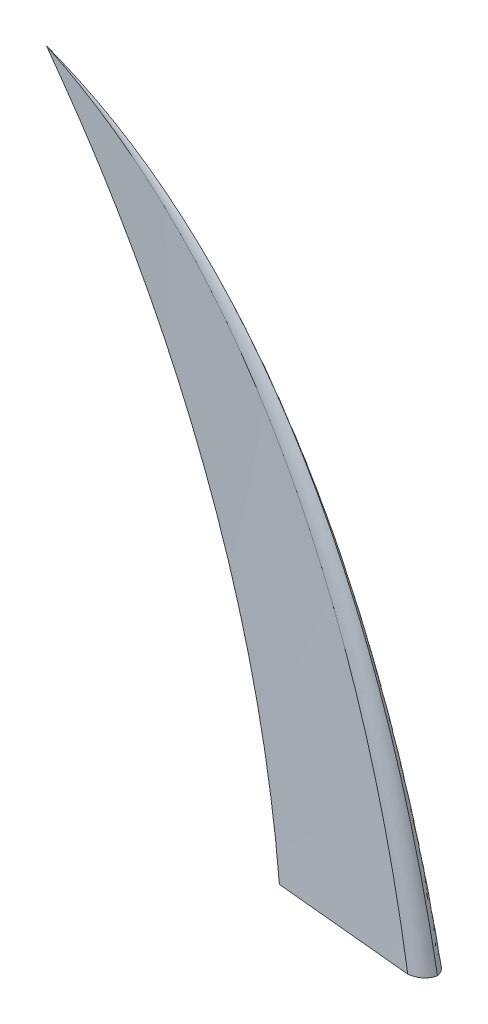
ISO-10303-21;
HEADER;
FILE_DESCRIPTION(('STEP AP214'),'2;1');
FILE_NAME('part.step','',(''),(''),'','','');
FILE_SCHEMA(('AUTOMOTIVE_DESIGN { 1 0 10303 214 1 1 1 1 }'));
ENDSEC;
DATA;
#1=APPLICATION_CONTEXT('core data for automotive mechanical design processes');
#2=APPLICATION_PROTOCOL_DEFINITION('international standard','automotive_design',2000,#1);
#3=PRODUCT_CONTEXT('',#1,'mechanical');
#4=PRODUCT('Part','Part','',(#3));
#5=PRODUCT_RELATED_PRODUCT_CATEGORY('part','',(#4));
#6=PRODUCT_DEFINITION_FORMATION('','',#4);
#7=PRODUCT_DEFINITION_CONTEXT('part definition',#1,'design');
#8=PRODUCT_DEFINITION('design','',#6,#7);
#9=PRODUCT_DEFINITION_SHAPE('','',#8);
#10=(LENGTH_UNIT() NAMED_UNIT(*) SI_UNIT(.MILLI.,.METRE.));
#11=(NAMED_UNIT(*) PLANE_ANGLE_UNIT() SI_UNIT($,.RADIAN.));
#12=(NAMED_UNIT(*) SI_UNIT($,.STERADIAN.) SOLID_ANGLE_UNIT());
#13=UNCERTAINTY_MEASURE_WITH_UNIT(LENGTH_MEASURE(1.E-05),#10,'distance_accuracy_value','');
#14=(GEOMETRIC_REPRESENTATION_CONTEXT(3) GLOBAL_UNCERTAINTY_ASSIGNED_CONTEXT((#13)) GLOBAL_UNIT_ASSIGNED_CONTEXT((#10,
#11,#12)) REPRESENTATION_CONTEXT('',''));
#15=CARTESIAN_POINT('',(0.,0.,0.));
#16=DIRECTION('',(0.,0.,1.));
#17=DIRECTION('',(1.,0.,0.));
#18=AXIS2_PLACEMENT_3D('',#15,#16,#17);
#19=CARTESIAN_POINT('',(-0.441611795280018,0.,-0.759416342925097));
#20=DIRECTION('',(0.,-1.,0.));
#21=DIRECTION('',(0.,0.,-1.));
#22=AXIS2_PLACEMENT_3D('',#19,#20,#21);
#23=PLANE('',#22);
#24=CARTESIAN_POINT('',(0.,0.,0.));
#25=CARTESIAN_POINT('',(-0.0350272810139364,0.,-0.159525126260187));
#26=CARTESIAN_POINT('',(-0.143656527907876,0.,-0.445619643007891));
#27=CARTESIAN_POINT('',(-0.422324452846984,0.,-0.775894210811432));
#28=CARTESIAN_POINT('',(-0.816716432384294,0.,-1.00730157129696));
#29=CARTESIAN_POINT('',(-1.15679378847463,0.,-1.09566167340864));
#30=CARTESIAN_POINT('',(-1.34611980895284,0.,-1.12336385657814));
#31=B_SPLINE_CURVE_WITH_KNOTS('',3,(#24,#25,#26,#27,#28,#29,#30),.UNSPECIFIED.,.F.,.F.,(4,1,1,1,
4),(0.,0.0325559858699069,0.0651119717398139,0.0976679576097208,0.130223943479628),.UNSPECIFIED.);
#32=CARTESIAN_POINT('',(0.,0.,0.));
#33=VERTEX_POINT('',#32);
#34=CARTESIAN_POINT('',(-1.34611980895284,0.,-1.12336385657814));
#35=VERTEX_POINT('',#34);
#36=EDGE_CURVE('E13',#33,#35,#31,.T.);
#37=ORIENTED_EDGE('',*,*,#36,.F.);
#38=CARTESIAN_POINT('',(-1.34611980895284,0.,1.12336385657814));
#39=CARTESIAN_POINT('',(-1.15679378847463,0.,1.09566167340864));
#40=CARTESIAN_POINT('',(-0.816716432384295,0.,1.00730157129696));
#41=CARTESIAN_POINT('',(-0.422324452846984,0.,0.775894210811432));
#42=CARTESIAN_POINT('',(-0.143656527907876,0.,0.44561964300789));
#43=CARTESIAN_POINT('',(-0.0350272810139364,0.,0.159525126260187));
#44=CARTESIAN_POINT('',(0.,0.,0.));
#45=B_SPLINE_CURVE_WITH_KNOTS('',3,(#38,#39,#40,#41,#42,#43,#44),.UNSPECIFIED.,.F.,.F.,(4,1,1,1,
4),(0.869776084203496,0.902332063152622,0.934888042101748,0.967444021050874,1.),.UNSPECIFIED.);
#46=CARTESIAN_POINT('',(-1.34611980895284,0.,1.12336385657814));
#47=VERTEX_POINT('',#46);
#48=EDGE_CURVE('E98',#47,#33,#45,.T.);
#49=ORIENTED_EDGE('',*,*,#48,.F.);
#50=DIRECTION('',(0.995482974612352,0.,0.0949402299183242));
#51=VECTOR('',#50,1.);
#52=CARTESIAN_POINT('',(-7.23555990447642,0.,0.56168192828907));
#53=LINE('',#52,#51);
#54=CARTESIAN_POINT('',(-13.125,0.,0.));
#55=VERTEX_POINT('',#54);
#56=EDGE_CURVE('E87',#55,#47,#53,.T.);
#57=ORIENTED_EDGE('',*,*,#56,.F.);
#58=DIRECTION('',(-0.995482974612352,0.,0.0949402299183241));
#59=VECTOR('',#58,1.);
#60=CARTESIAN_POINT('',(-7.23555990447642,0.,-0.56168192828907));
#61=LINE('',#60,#59);
#62=EDGE_CURVE('E82',#35,#55,#61,.T.);
#63=ORIENTED_EDGE('',*,*,#62,.F.);
#64=EDGE_LOOP('',(#37,#49,#57,#63));
#65=FACE_BOUND('',#64,.T.);
#66=ADVANCED_FACE('F66',(#65),#23,.T.);
#67=CARTESIAN_POINT('',(0.,0.,0.));
#68=CARTESIAN_POINT('',(-3.64642343566585,19.5292195969327,0.));
#69=CARTESIAN_POINT('',(-12.3464493503701,43.1462647461359,0.));
#70=CARTESIAN_POINT('',(-32.4324240557592,50.6,0.));
#71=CARTESIAN_POINT('',(-0.0350272810139364,0.,-0.159525126260187));
#72=CARTESIAN_POINT('',(-3.69497272898941,19.514977188393,-0.106453625897233));
#73=CARTESIAN_POINT('',(-12.409402297454,43.0680553468621,-0.0533821255342788));
#74=CARTESIAN_POINT('',(-32.4327798082133,50.6,-0.000310625171324509));
#75=CARTESIAN_POINT('',(-0.143656527907876,0.,-0.445619643007891));
#76=CARTESIAN_POINT('',(-3.81778777221389,19.4864923713136,-0.297390387176585));
#77=CARTESIAN_POINT('',(-12.5481664199104,42.9116365483146,-0.149161131345279));
#78=CARTESIAN_POINT('',(-32.4334913131214,50.6,-0.000931875513973526));
#79=CARTESIAN_POINT('',(-0.422324452846984,0.,-0.775894210811432));
#80=CARTESIAN_POINT('',(-4.07915970678275,19.4437651456945,-0.517884057550271));
#81=CARTESIAN_POINT('',(-12.794887288461,42.6770083504934,-0.259873904289109));
#82=CARTESIAN_POINT('',(-32.4345585704836,50.6,-0.00186375102794705));
#83=CARTESIAN_POINT('',(-0.816716432384294,0.,-1.00730157129696));
#84=CARTESIAN_POINT('',(-4.41768101108374,19.4010379200754,-0.672466256378614));
#85=CARTESIAN_POINT('',(-13.0801828418777,42.4423801526722,-0.337630941460267));
#86=CARTESIAN_POINT('',(-32.4356258278458,50.6,-0.00279562654192058));
#87=CARTESIAN_POINT('',(-1.15679378847463,0.,-1.09566167340864));
#88=CARTESIAN_POINT('',(-4.69479479377249,19.372553102996,-0.731580074567282));
#89=CARTESIAN_POINT('',(-13.2960963340662,42.2859613541247,-0.367498475725926));
#90=CARTESIAN_POINT('',(-32.4363373327539,50.6,-0.0034168768845696));
#91=CARTESIAN_POINT('',(-1.34611980895284,0.,-1.12336385657814));
#92=CARTESIAN_POINT('',(-4.84620991340555,19.3583106944563,-0.750151738404059));
#93=CARTESIAN_POINT('',(-13.4104821943048,42.2077519548509,-0.376939620229976));
#94=CARTESIAN_POINT('',(-32.436693085208,50.6,-0.00372750205589411));
#95=B_SPLINE_SURFACE_WITH_KNOTS('',3,3,((#67,#68,#69,#70),(#71,#72,#73,#74),(#75,#76,#77,#78),
(#79,#80,#81,#82),(#83,#84,#85,#86),(#87,#88,#89,#90),(#91,#92,#93,#94)),.UNSPECIFIED.,.F.,.F.,
.F.,(4,1,1,1,4),(4,4),(0.,0.0325559858699069,0.0651119717398139,0.0976679576097208,
0.130223943479628),(0.,1.),.UNSPECIFIED.);
#96=CARTESIAN_POINT('',(-1.34611980895284,0.,-1.12336385657814));
#97=CARTESIAN_POINT('',(-4.84620991340555,19.3583106944563,-0.750151738404059));
#98=CARTESIAN_POINT('',(-13.4104821943048,42.2077519548509,-0.376939620229976));
#99=CARTESIAN_POINT('',(-32.436693085208,50.6,-0.00372750205589411));
#100=B_SPLINE_CURVE_WITH_KNOTS('',3,(#96,#97,#98,#99),.UNSPECIFIED.,.F.,.F.,(4,4),(0.,1.),.UNSPECIFIED.);
#101=CARTESIAN_POINT('',(-32.4506815676374,50.6,0.));
#102=VERTEX_POINT('',#101);
#103=EDGE_CURVE('E75',#35,#102,#100,.T.);
#104=CARTESIAN_POINT('',(0.,0.,0.));
#105=CARTESIAN_POINT('',(-3.64642343566585,19.5292195969327,0.));
#106=CARTESIAN_POINT('',(-12.3464493503701,43.1462647461359,0.));
#107=CARTESIAN_POINT('',(-32.4324240557592,50.6,0.));
#108=B_SPLINE_CURVE_WITH_KNOTS('',3,(#104,#105,#106,#107),.UNSPECIFIED.,.F.,.F.,(4,4),(0.,1.),.UNSPECIFIED.);
#109=EDGE_CURVE('E101',#33,#102,#108,.T.);
#110=ORIENTED_EDGE('',*,*,#36,.T.);
#111=ORIENTED_EDGE('',*,*,#103,.T.);
#112=ORIENTED_EDGE('',*,*,#109,.F.);
#113=EDGE_LOOP('',(#110,#111,#112));
#114=FACE_BOUND('',#113,.T.);
#115=ADVANCED_FACE('F107',(#114),#95,.T.);
#116=CARTESIAN_POINT('',(-1.34611980895284,0.,-1.12336385657814));
#117=CARTESIAN_POINT('',(-4.84620991340555,19.3583106944563,-0.750151738404059));
#118=CARTESIAN_POINT('',(-13.4104821943048,42.2077519548509,-0.376939620229976));
#119=CARTESIAN_POINT('',(-32.436693085208,50.6,-0.00372750205589411));
#120=CARTESIAN_POINT('',(-2.32769315820677,0.,-1.0297502018633));
#121=CARTESIAN_POINT('',(-5.66933420350671,19.263184517165,-0.687639093537054));
#122=CARTESIAN_POINT('',(-14.0810459784926,41.685385168333,-0.345527985210812));
#123=CARTESIAN_POINT('',(-32.4404015842592,50.6,-0.0034168768845696));
#124=CARTESIAN_POINT('',(-4.29083985671464,0.,-0.842522892433607));
#125=CARTESIAN_POINT('',(-7.31558278370904,19.0729321625824,-0.562613803803045));
#126=CARTESIAN_POINT('',(-15.4221735468683,40.6406515952972,-0.282704715172483));
#127=CARTESIAN_POINT('',(-32.4478185823618,50.6,-0.00279562654192058));
#128=CARTESIAN_POINT('',(-7.23555990447641,0.,-0.561681928289069));
#129=CARTESIAN_POINT('',(-9.78495565401246,18.7875536307085,-0.375075869202029));
#130=CARTESIAN_POINT('',(-17.4338648994318,39.0735512357435,-0.188469810114988));
#131=CARTESIAN_POINT('',(-32.4589440795155,50.6,-0.00186375102794705));
#132=CARTESIAN_POINT('',(-10.1802799522382,0.,-0.280840964144536));
#133=CARTESIAN_POINT('',(-12.254328524316,18.5021750988347,-0.187537934601015));
#134=CARTESIAN_POINT('',(-19.4455562519954,37.5064508761898,-0.0942349050574944));
#135=CARTESIAN_POINT('',(-32.4700695766695,50.6,-0.000931875513973526));
#136=CARTESIAN_POINT('',(-12.1434266507461,0.,-0.093613654714845));
#137=CARTESIAN_POINT('',(-13.9005771045182,18.3119227442521,-0.0625126448670049));
#138=CARTESIAN_POINT('',(-20.786683820371,36.4617173031539,-0.0314116350191647));
#139=CARTESIAN_POINT('',(-32.477486574772,50.6,-0.000310625171324509));
#140=CARTESIAN_POINT('',(-13.125,0.,0.));
#141=CARTESIAN_POINT('',(-14.7237013946194,18.2167965669608,0.));
#142=CARTESIAN_POINT('',(-21.4572476045589,35.939350516636,0.));
#143=CARTESIAN_POINT('',(-32.4811950738232,50.6,0.));
#144=B_SPLINE_SURFACE_WITH_KNOTS('',3,3,((#116,#117,#118,#119),(#120,#121,#122,#123),(#124,#125,
#126,#127),(#128,#129,#130,#131),(#132,#133,#134,#135),(#136,#137,#138,#139),(#140,#141,#142,
#143)),.UNSPECIFIED.,.F.,.F.,.F.,(4,1,1,1,4),(4,4),(0.130223943479628,0.347667957609721,
0.565111971739814,0.782555985869907,1.),(0.,1.),.UNSPECIFIED.);
#145=CARTESIAN_POINT('',(-13.125,0.,0.));
#146=CARTESIAN_POINT('',(-14.7237013946194,18.2167965669608,0.));
#147=CARTESIAN_POINT('',(-21.4572476045589,35.939350516636,0.));
#148=CARTESIAN_POINT('',(-32.4811950738232,50.6,0.));
#149=B_SPLINE_CURVE_WITH_KNOTS('',3,(#145,#146,#147,#148),.UNSPECIFIED.,.F.,.F.,(4,4),(0.,1.),.UNSPECIFIED.);
#150=EDGE_CURVE('E180',#55,#102,#149,.T.);
#151=ORIENTED_EDGE('',*,*,#62,.T.);
#152=ORIENTED_EDGE('',*,*,#150,.T.);
#153=ORIENTED_EDGE('',*,*,#103,.F.);
#154=EDGE_LOOP('',(#151,#152,#153));
#155=FACE_BOUND('',#154,.T.);
#156=ADVANCED_FACE('F113',(#155),#144,.T.);
#157=CARTESIAN_POINT('',(-13.125,0.,0.));
#158=CARTESIAN_POINT('',(-14.7237013946194,18.2167965669608,0.));
#159=CARTESIAN_POINT('',(-21.4572476045589,35.939350516636,0.));
#160=CARTESIAN_POINT('',(-32.4811950738232,50.6,0.));
#161=CARTESIAN_POINT('',(-12.1434266507461,0.,0.0936136547148451));
#162=CARTESIAN_POINT('',(-13.9005770991869,18.3119227472798,0.0625126448670049));
#163=CARTESIAN_POINT('',(-20.7866838095209,36.4617173197797,0.0314116350191647));
#164=CARTESIAN_POINT('',(-32.477486574772,50.6,0.000310625171324509));
#165=CARTESIAN_POINT('',(-10.1802799522382,0.,0.280840964144536));
#166=CARTESIAN_POINT('',(-12.2543285083219,18.5021751079177,0.187537934601015));
#167=CARTESIAN_POINT('',(-19.445556219445,37.5064509260672,0.0942349050574943));
#168=CARTESIAN_POINT('',(-32.4700695766694,50.6,0.000931875513973525));
#169=CARTESIAN_POINT('',(-7.23555990447642,0.,0.56168192828907));
#170=CARTESIAN_POINT('',(-9.78495562202434,18.7875536488745,0.375075869202029));
#171=CARTESIAN_POINT('',(-17.433864834331,39.0735513354984,0.188469810114988));
#172=CARTESIAN_POINT('',(-32.4589440795156,50.6,0.00186375102794705));
#173=CARTESIAN_POINT('',(-4.29083985671463,0.,0.842522892433606));
#174=CARTESIAN_POINT('',(-7.31558273572682,19.0729321898314,0.562613803803044));
#175=CARTESIAN_POINT('',(-15.4221734492171,40.6406517449296,0.282704715172482));
#176=CARTESIAN_POINT('',(-32.4478185823618,50.6,0.00279562654192058));
#177=CARTESIAN_POINT('',(-2.32769315820677,0.,1.0297502018633));
#178=CARTESIAN_POINT('',(-5.66933414486179,19.2631845504693,0.687639093537054));
#179=CARTESIAN_POINT('',(-14.0810458591412,41.6853853512171,0.345527985210812));
#180=CARTESIAN_POINT('',(-32.4404015842593,50.6,0.0034168768845696));
#181=CARTESIAN_POINT('',(-1.34611980895284,0.,1.12336385657814));
#182=CARTESIAN_POINT('',(-4.84620984942928,19.3583107307882,0.750151738404059));
#183=CARTESIAN_POINT('',(-13.4104820641032,42.2077521543608,0.376939620229976));
#184=CARTESIAN_POINT('',(-32.436693085208,50.6,0.00372750205589411));
#185=B_SPLINE_SURFACE_WITH_KNOTS('',3,3,((#157,#158,#159,#160),(#161,#162,#163,#164),(#165,#166,
#167,#168),(#169,#170,#171,#172),(#173,#174,#175,#176),(#177,#178,#179,#180),(#181,#182,#183,
#184)),.UNSPECIFIED.,.F.,.F.,.F.,(4,1,1,1,4),(4,4),(0.,0.217444021050874,0.434888042101748,
0.652332063152622,0.869776084203496),(0.,1.),.UNSPECIFIED.);
#186=CARTESIAN_POINT('',(-1.34611980895284,0.,1.12336385657814));
#187=CARTESIAN_POINT('',(-4.84620984942928,19.3583107307882,0.750151738404059));
#188=CARTESIAN_POINT('',(-13.4104820641032,42.2077521543608,0.376939620229976));
#189=CARTESIAN_POINT('',(-32.436693085208,50.6,0.00372750205589411));
#190=B_SPLINE_CURVE_WITH_KNOTS('',3,(#186,#187,#188,#189),.UNSPECIFIED.,.F.,.F.,(4,4),(0.,1.),.UNSPECIFIED.);
#191=EDGE_CURVE('E103',#47,#102,#190,.T.);
#192=ORIENTED_EDGE('',*,*,#56,.T.);
#193=ORIENTED_EDGE('',*,*,#191,.T.);
#194=ORIENTED_EDGE('',*,*,#150,.F.);
#195=EDGE_LOOP('',(#192,#193,#194));
#196=FACE_BOUND('',#195,.T.);
#197=ADVANCED_FACE('F117',(#196),#185,.T.);
#198=CARTESIAN_POINT('',(-1.34611980895284,0.,1.12336385657814));
#199=CARTESIAN_POINT('',(-4.84620984942928,19.3583107307882,0.750151738404059));
#200=CARTESIAN_POINT('',(-13.4104820641032,42.2077521543608,0.376939620229976));
#201=CARTESIAN_POINT('',(-32.436693085208,50.6,0.00372750205589411));
#202=CARTESIAN_POINT('',(-1.15679378847463,0.,1.09566167340864));
#203=CARTESIAN_POINT('',(-4.69479473512757,19.3725531363003,0.731580074567282));
#204=CARTESIAN_POINT('',(-13.2960962147147,42.2859615370088,0.367498475725926));
#205=CARTESIAN_POINT('',(-32.4363373327539,50.6,0.0034168768845696));
#206=CARTESIAN_POINT('',(-0.816716432384295,0.,1.00730157129696));
#207=CARTESIAN_POINT('',(-4.41768096310154,19.4010379473243,0.672466256378615));
#208=CARTESIAN_POINT('',(-13.0801827442265,42.4423803023046,0.337630941460268));
#209=CARTESIAN_POINT('',(-32.4356258278458,50.6,0.00279562654192058));
#210=CARTESIAN_POINT('',(-0.422324452846984,0.,0.775894210811432));
#211=CARTESIAN_POINT('',(-4.07915967479461,19.4437651638605,0.51788405755027));
#212=CARTESIAN_POINT('',(-12.7948872233602,42.6770084502484,0.259873904289109));
#213=CARTESIAN_POINT('',(-32.4345585704836,50.6,0.00186375102794705));
#214=CARTESIAN_POINT('',(-0.143656527907876,0.,0.44561964300789));
#215=CARTESIAN_POINT('',(-3.81778775621983,19.4864923803966,0.297390387176585));
#216=CARTESIAN_POINT('',(-12.54816638736,42.9116365981921,0.149161131345279));
#217=CARTESIAN_POINT('',(-32.4334913131214,50.6,0.000931875513973526));
#218=CARTESIAN_POINT('',(-0.0350272810139364,0.,0.159525126260187));
#219=CARTESIAN_POINT('',(-3.69497272365805,19.5149771914206,0.106453625897233));
#220=CARTESIAN_POINT('',(-12.4094022866038,43.068055363488,0.0533821255342787));
#221=CARTESIAN_POINT('',(-32.4327798082133,50.6,0.000310625171324508));
#222=CARTESIAN_POINT('',(0.,0.,0.));
#223=CARTESIAN_POINT('',(-3.64642343566585,19.5292195969327,0.));
#224=CARTESIAN_POINT('',(-12.3464493503701,43.1462647461359,0.));
#225=CARTESIAN_POINT('',(-32.4324240557592,50.6,0.));
#226=B_SPLINE_SURFACE_WITH_KNOTS('',3,3,((#198,#199,#200,#201),(#202,#203,#204,#205),(#206,#207,
#208,#209),(#210,#211,#212,#213),(#214,#215,#216,#217),(#218,#219,#220,#221),(#222,#223,#224,
#225)),.UNSPECIFIED.,.F.,.F.,.F.,(4,1,1,1,4),(4,4),(0.869776084203496,0.902332063152622,
0.934888042101748,0.967444021050874,1.),(0.,1.),.UNSPECIFIED.);
#227=ORIENTED_EDGE('',*,*,#48,.T.);
#228=ORIENTED_EDGE('',*,*,#109,.T.);
#229=ORIENTED_EDGE('',*,*,#191,.F.);
#230=EDGE_LOOP('',(#227,#228,#229));
#231=FACE_BOUND('',#230,.T.);
#232=ADVANCED_FACE('F100',(#231),#226,.T.);
#233=CLOSED_SHELL('',(#66,#115,#156,#197,#232));
#234=MANIFOLD_SOLID_BREP('B2',#233);
#235=ADVANCED_BREP_SHAPE_REPRESENTATION('',(#18,#234),#14);
#236=SHAPE_DEFINITION_REPRESENTATION(#9,#235);
ENDSEC;
END-ISO-10303-21;
